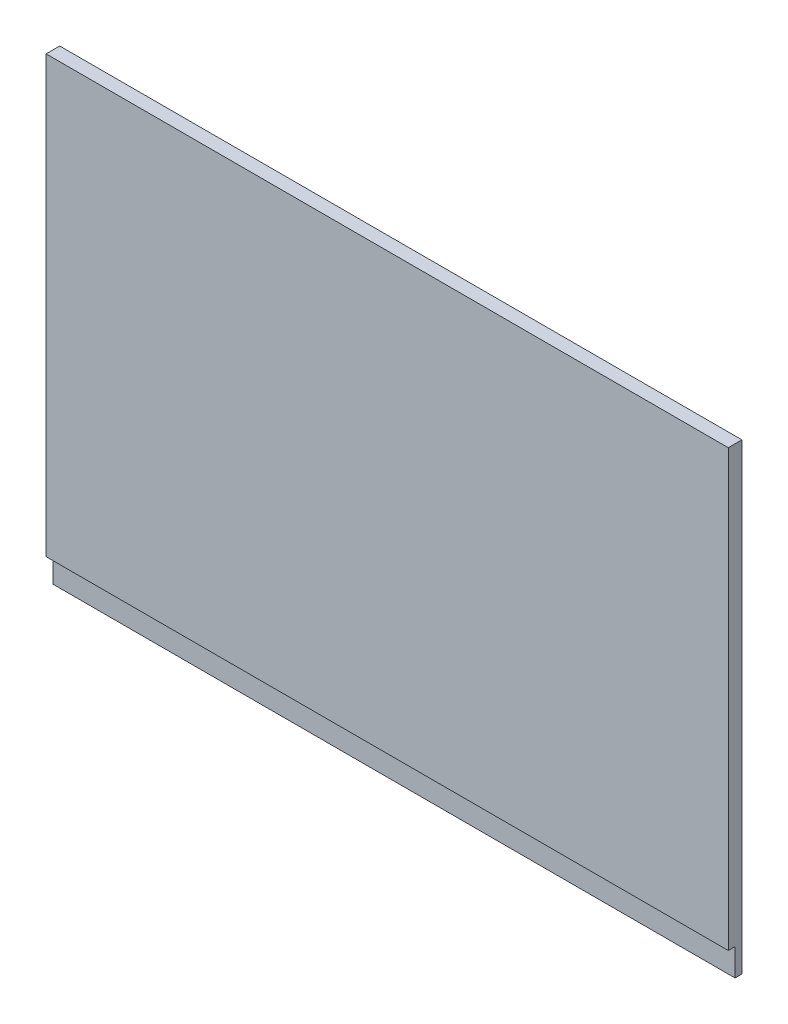
ISO-10303-21;
HEADER;
FILE_DESCRIPTION(('STEP AP214'),'2;1');
FILE_NAME('part.step','',(''),(''),'','','');
FILE_SCHEMA(('AUTOMOTIVE_DESIGN { 1 0 10303 214 1 1 1 1 }'));
ENDSEC;
DATA;
#1=APPLICATION_CONTEXT('core data for automotive mechanical design processes');
#2=APPLICATION_PROTOCOL_DEFINITION('international standard','automotive_design',2000,#1);
#3=PRODUCT_CONTEXT('',#1,'mechanical');
#4=PRODUCT('Part','Part','',(#3));
#5=PRODUCT_RELATED_PRODUCT_CATEGORY('part','',(#4));
#6=PRODUCT_DEFINITION_FORMATION('','',#4);
#7=PRODUCT_DEFINITION_CONTEXT('part definition',#1,'design');
#8=PRODUCT_DEFINITION('design','',#6,#7);
#9=PRODUCT_DEFINITION_SHAPE('','',#8);
#10=(LENGTH_UNIT() NAMED_UNIT(*) SI_UNIT(.MILLI.,.METRE.));
#11=(NAMED_UNIT(*) PLANE_ANGLE_UNIT() SI_UNIT($,.RADIAN.));
#12=(NAMED_UNIT(*) SI_UNIT($,.STERADIAN.) SOLID_ANGLE_UNIT());
#13=UNCERTAINTY_MEASURE_WITH_UNIT(LENGTH_MEASURE(1.E-05),#10,'distance_accuracy_value','');
#14=(GEOMETRIC_REPRESENTATION_CONTEXT(3) GLOBAL_UNCERTAINTY_ASSIGNED_CONTEXT((#13)) GLOBAL_UNIT_ASSIGNED_CONTEXT((#10,
#11,#12)) REPRESENTATION_CONTEXT('',''));
#15=CARTESIAN_POINT('',(0.,0.,0.));
#16=DIRECTION('',(0.,0.,1.));
#17=DIRECTION('',(1.,0.,0.));
#18=AXIS2_PLACEMENT_3D('',#15,#16,#17);
#19=CARTESIAN_POINT('',(0.,0.,3.175));
#20=DIRECTION('',(-1.,0.,0.));
#21=DIRECTION('',(0.,0.,1.));
#22=AXIS2_PLACEMENT_3D('',#19,#20,#21);
#23=PLANE('',#22);
#24=DIRECTION('',(0.,1.,0.));
#25=VECTOR('',#24,1.);
#26=CARTESIAN_POINT('',(0.,0.,3.175));
#27=LINE('',#26,#25);
#28=CARTESIAN_POINT('',(0.,6.35,3.175));
#29=VERTEX_POINT('',#28);
#30=CARTESIAN_POINT('',(0.,107.95,3.175));
#31=VERTEX_POINT('',#30);
#32=EDGE_CURVE('E109',#29,#31,#27,.T.);
#33=ORIENTED_EDGE('',*,*,#32,.F.);
#34=DIRECTION('',(0.,0.,1.));
#35=VECTOR('',#34,1.);
#36=CARTESIAN_POINT('',(0.,6.35,1.5875));
#37=LINE('',#36,#35);
#38=CARTESIAN_POINT('',(0.,6.35,1.5875));
#39=VERTEX_POINT('',#38);
#40=EDGE_CURVE('E57',#39,#29,#37,.T.);
#41=ORIENTED_EDGE('',*,*,#40,.F.);
#42=DIRECTION('',(0.,1.,0.));
#43=VECTOR('',#42,1.);
#44=CARTESIAN_POINT('',(0.,0.,1.5875));
#45=LINE('',#44,#43);
#46=CARTESIAN_POINT('',(0.,0.,1.5875));
#47=VERTEX_POINT('',#46);
#48=EDGE_CURVE('E94',#47,#39,#45,.T.);
#49=ORIENTED_EDGE('',*,*,#48,.F.);
#50=DIRECTION('',(0.,0.,-1.));
#51=VECTOR('',#50,1.);
#52=CARTESIAN_POINT('',(0.,0.,3.175));
#53=LINE('',#52,#51);
#54=CARTESIAN_POINT('',(0.,0.,0.));
#55=VERTEX_POINT('',#54);
#56=EDGE_CURVE('E86',#47,#55,#53,.T.);
#57=ORIENTED_EDGE('',*,*,#56,.T.);
#58=DIRECTION('',(0.,1.,0.));
#59=VECTOR('',#58,1.);
#60=CARTESIAN_POINT('',(0.,0.,0.));
#61=LINE('',#60,#59);
#62=CARTESIAN_POINT('',(0.,107.95,0.));
#63=VERTEX_POINT('',#62);
#64=EDGE_CURVE('E91',#55,#63,#61,.T.);
#65=ORIENTED_EDGE('',*,*,#64,.T.);
#66=DIRECTION('',(0.,0.,-1.));
#67=VECTOR('',#66,1.);
#68=CARTESIAN_POINT('',(0.,107.95,3.175));
#69=LINE('',#68,#67);
#70=EDGE_CURVE('E11',#31,#63,#69,.T.);
#71=ORIENTED_EDGE('',*,*,#70,.F.);
#72=EDGE_LOOP('',(#33,#41,#49,#57,#65,#71));
#73=FACE_BOUND('',#72,.T.);
#74=ADVANCED_FACE('F42',(#73),#23,.F.);
#75=CARTESIAN_POINT('',(0.,107.95,3.175));
#76=DIRECTION('',(0.,-1.,0.));
#77=DIRECTION('',(1.,0.,0.));
#78=AXIS2_PLACEMENT_3D('',#75,#76,#77);
#79=PLANE('',#78);
#80=DIRECTION('',(-1.,0.,0.));
#81=VECTOR('',#80,1.);
#82=CARTESIAN_POINT('',(0.,107.95,0.));
#83=LINE('',#82,#81);
#84=CARTESIAN_POINT('',(-159.1564,107.95,0.));
#85=VERTEX_POINT('',#84);
#86=EDGE_CURVE('E113',#63,#85,#83,.T.);
#87=ORIENTED_EDGE('',*,*,#86,.T.);
#88=DIRECTION('',(0.,0.,-1.));
#89=VECTOR('',#88,1.);
#90=CARTESIAN_POINT('',(-159.1564,107.95,3.175));
#91=LINE('',#90,#89);
#92=CARTESIAN_POINT('',(-159.1564,107.95,3.175));
#93=VERTEX_POINT('',#92);
#94=EDGE_CURVE('E50',#93,#85,#91,.T.);
#95=ORIENTED_EDGE('',*,*,#94,.F.);
#96=DIRECTION('',(-1.,0.,0.));
#97=VECTOR('',#96,1.);
#98=CARTESIAN_POINT('',(0.,107.95,3.175));
#99=LINE('',#98,#97);
#100=EDGE_CURVE('E66',#31,#93,#99,.T.);
#101=ORIENTED_EDGE('',*,*,#100,.F.);
#102=ORIENTED_EDGE('',*,*,#70,.T.);
#103=EDGE_LOOP('',(#87,#95,#101,#102));
#104=FACE_BOUND('',#103,.T.);
#105=ADVANCED_FACE('F135',(#104),#79,.F.);
#106=CARTESIAN_POINT('',(-159.1564,0.,3.175));
#107=DIRECTION('',(1.,0.,0.));
#108=DIRECTION('',(0.,0.,-1.));
#109=AXIS2_PLACEMENT_3D('',#106,#107,#108);
#110=PLANE('',#109);
#111=DIRECTION('',(0.,-1.,0.));
#112=VECTOR('',#111,1.);
#113=CARTESIAN_POINT('',(-159.1564,0.,1.5875));
#114=LINE('',#113,#112);
#115=CARTESIAN_POINT('',(-159.1564,6.35,1.5875));
#116=VERTEX_POINT('',#115);
#117=CARTESIAN_POINT('',(-159.1564,0.,1.5875));
#118=VERTEX_POINT('',#117);
#119=EDGE_CURVE('E147',#116,#118,#114,.T.);
#120=ORIENTED_EDGE('',*,*,#119,.F.);
#121=DIRECTION('',(0.,0.,1.));
#122=VECTOR('',#121,1.);
#123=CARTESIAN_POINT('',(-159.1564,6.35,1.5875));
#124=LINE('',#123,#122);
#125=CARTESIAN_POINT('',(-159.1564,6.35,3.175));
#126=VERTEX_POINT('',#125);
#127=EDGE_CURVE('E115',#116,#126,#124,.T.);
#128=ORIENTED_EDGE('',*,*,#127,.T.);
#129=DIRECTION('',(0.,-1.,0.));
#130=VECTOR('',#129,1.);
#131=CARTESIAN_POINT('',(-159.1564,0.,3.175));
#132=LINE('',#131,#130);
#133=EDGE_CURVE('E99',#93,#126,#132,.T.);
#134=ORIENTED_EDGE('',*,*,#133,.F.);
#135=ORIENTED_EDGE('',*,*,#94,.T.);
#136=DIRECTION('',(0.,-1.,0.));
#137=VECTOR('',#136,1.);
#138=CARTESIAN_POINT('',(-159.1564,0.,0.));
#139=LINE('',#138,#137);
#140=CARTESIAN_POINT('',(-159.1564,0.,0.));
#141=VERTEX_POINT('',#140);
#142=EDGE_CURVE('E110',#85,#141,#139,.T.);
#143=ORIENTED_EDGE('',*,*,#142,.T.);
#144=DIRECTION('',(0.,0.,-1.));
#145=VECTOR('',#144,1.);
#146=CARTESIAN_POINT('',(-159.1564,0.,3.175));
#147=LINE('',#146,#145);
#148=EDGE_CURVE('E98',#118,#141,#147,.T.);
#149=ORIENTED_EDGE('',*,*,#148,.F.);
#150=EDGE_LOOP('',(#120,#128,#134,#135,#143,#149));
#151=FACE_BOUND('',#150,.T.);
#152=ADVANCED_FACE('F133',(#151),#110,.F.);
#153=CARTESIAN_POINT('',(0.,0.,3.175));
#154=DIRECTION('',(0.,1.,0.));
#155=DIRECTION('',(-1.,0.,0.));
#156=AXIS2_PLACEMENT_3D('',#153,#154,#155);
#157=PLANE('',#156);
#158=ORIENTED_EDGE('',*,*,#56,.F.);
#159=DIRECTION('',(1.,0.,0.));
#160=VECTOR('',#159,1.);
#161=CARTESIAN_POINT('',(-159.1564,0.,1.5875));
#162=LINE('',#161,#160);
#163=EDGE_CURVE('E153',#118,#47,#162,.T.);
#164=ORIENTED_EDGE('',*,*,#163,.F.);
#165=ORIENTED_EDGE('',*,*,#148,.T.);
#166=DIRECTION('',(1.,0.,0.));
#167=VECTOR('',#166,1.);
#168=CARTESIAN_POINT('',(0.,0.,0.));
#169=LINE('',#168,#167);
#170=EDGE_CURVE('E102',#141,#55,#169,.T.);
#171=ORIENTED_EDGE('',*,*,#170,.T.);
#172=EDGE_LOOP('',(#158,#164,#165,#171));
#173=FACE_BOUND('',#172,.T.);
#174=ADVANCED_FACE('F103',(#173),#157,.F.);
#175=CARTESIAN_POINT('',(0.,0.,3.175));
#176=DIRECTION('',(0.,0.,1.));
#177=DIRECTION('',(1.,0.,0.));
#178=AXIS2_PLACEMENT_3D('',#175,#176,#177);
#179=PLANE('',#178);
#180=DIRECTION('',(-1.,0.,0.));
#181=VECTOR('',#180,1.);
#182=CARTESIAN_POINT('',(-159.1564,6.35,3.175));
#183=LINE('',#182,#181);
#184=EDGE_CURVE('E144',#29,#126,#183,.T.);
#185=ORIENTED_EDGE('',*,*,#184,.F.);
#186=ORIENTED_EDGE('',*,*,#32,.T.);
#187=ORIENTED_EDGE('',*,*,#100,.T.);
#188=ORIENTED_EDGE('',*,*,#133,.T.);
#189=EDGE_LOOP('',(#185,#186,#187,#188));
#190=FACE_BOUND('',#189,.T.);
#191=ADVANCED_FACE('F169',(#190),#179,.T.);
#192=CARTESIAN_POINT('',(0.,0.,0.));
#193=DIRECTION('',(0.,0.,1.));
#194=DIRECTION('',(1.,0.,0.));
#195=AXIS2_PLACEMENT_3D('',#192,#193,#194);
#196=PLANE('',#195);
#197=ORIENTED_EDGE('',*,*,#64,.F.);
#198=ORIENTED_EDGE('',*,*,#170,.F.);
#199=ORIENTED_EDGE('',*,*,#142,.F.);
#200=ORIENTED_EDGE('',*,*,#86,.F.);
#201=EDGE_LOOP('',(#197,#198,#199,#200));
#202=FACE_BOUND('',#201,.T.);
#203=ADVANCED_FACE('F112',(#202),#196,.F.);
#204=CARTESIAN_POINT('',(-159.1564,6.35,1.5875));
#205=DIRECTION('',(0.,1.,0.));
#206=DIRECTION('',(0.,0.,1.));
#207=AXIS2_PLACEMENT_3D('',#204,#205,#206);
#208=PLANE('',#207);
#209=ORIENTED_EDGE('',*,*,#184,.T.);
#210=ORIENTED_EDGE('',*,*,#127,.F.);
#211=DIRECTION('',(-1.,0.,0.));
#212=VECTOR('',#211,1.);
#213=CARTESIAN_POINT('',(-159.1564,6.35,1.5875));
#214=LINE('',#213,#212);
#215=EDGE_CURVE('E142',#39,#116,#214,.T.);
#216=ORIENTED_EDGE('',*,*,#215,.F.);
#217=ORIENTED_EDGE('',*,*,#40,.T.);
#218=EDGE_LOOP('',(#209,#210,#216,#217));
#219=FACE_BOUND('',#218,.T.);
#220=ADVANCED_FACE('F168',(#219),#208,.F.);
#221=CARTESIAN_POINT('',(0.,0.,1.5875));
#222=DIRECTION('',(0.,0.,-1.));
#223=DIRECTION('',(-1.,0.,0.));
#224=AXIS2_PLACEMENT_3D('',#221,#222,#223);
#225=PLANE('',#224);
#226=ORIENTED_EDGE('',*,*,#119,.T.);
#227=ORIENTED_EDGE('',*,*,#163,.T.);
#228=ORIENTED_EDGE('',*,*,#48,.T.);
#229=ORIENTED_EDGE('',*,*,#215,.T.);
#230=EDGE_LOOP('',(#226,#227,#228,#229));
#231=FACE_BOUND('',#230,.T.);
#232=ADVANCED_FACE('F161',(#231),#225,.F.);
#233=CLOSED_SHELL('',(#74,#105,#152,#174,#191,#203,#220,#232));
#234=MANIFOLD_SOLID_BREP('B2',#233);
#235=ADVANCED_BREP_SHAPE_REPRESENTATION('',(#18,#234),#14);
#236=SHAPE_DEFINITION_REPRESENTATION(#9,#235);
ENDSEC;
END-ISO-10303-21;
